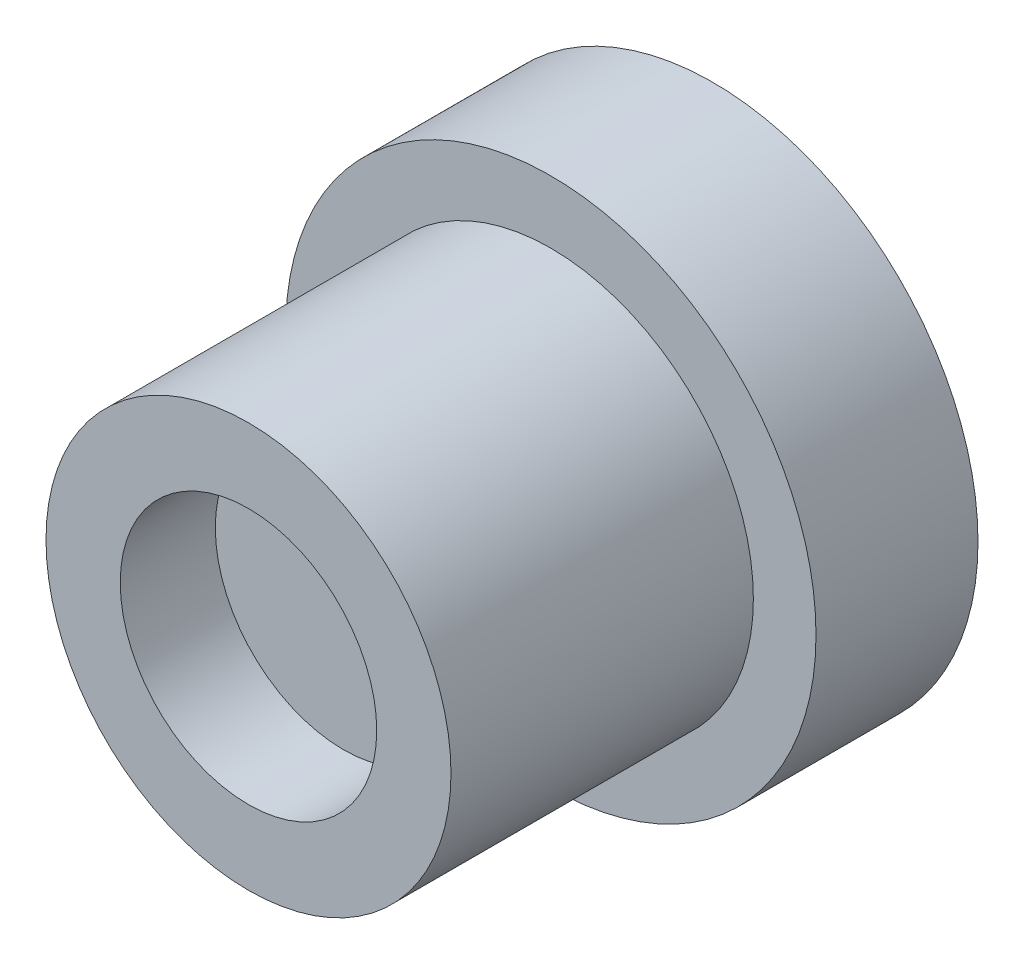
ISO-10303-21;
HEADER;
FILE_DESCRIPTION(('STEP AP214'),'2;1');
FILE_NAME('part.step','',(''),(''),'','','');
FILE_SCHEMA(('AUTOMOTIVE_DESIGN { 1 0 10303 214 1 1 1 1 }'));
ENDSEC;
DATA;
#1=APPLICATION_CONTEXT('core data for automotive mechanical design processes');
#2=APPLICATION_PROTOCOL_DEFINITION('international standard','automotive_design',2000,#1);
#3=PRODUCT_CONTEXT('',#1,'mechanical');
#4=PRODUCT('Part','Part','',(#3));
#5=PRODUCT_RELATED_PRODUCT_CATEGORY('part','',(#4));
#6=PRODUCT_DEFINITION_FORMATION('','',#4);
#7=PRODUCT_DEFINITION_CONTEXT('part definition',#1,'design');
#8=PRODUCT_DEFINITION('design','',#6,#7);
#9=PRODUCT_DEFINITION_SHAPE('','',#8);
#10=(LENGTH_UNIT() NAMED_UNIT(*) SI_UNIT(.MILLI.,.METRE.));
#11=(NAMED_UNIT(*) PLANE_ANGLE_UNIT() SI_UNIT($,.RADIAN.));
#12=(NAMED_UNIT(*) SI_UNIT($,.STERADIAN.) SOLID_ANGLE_UNIT());
#13=UNCERTAINTY_MEASURE_WITH_UNIT(LENGTH_MEASURE(1.E-05),#10,'distance_accuracy_value','');
#14=(GEOMETRIC_REPRESENTATION_CONTEXT(3) GLOBAL_UNCERTAINTY_ASSIGNED_CONTEXT((#13)) GLOBAL_UNIT_ASSIGNED_CONTEXT((#10,
#11,#12)) REPRESENTATION_CONTEXT('',''));
#15=CARTESIAN_POINT('',(0.,0.,0.));
#16=DIRECTION('',(0.,0.,1.));
#17=DIRECTION('',(1.,0.,0.));
#18=AXIS2_PLACEMENT_3D('',#15,#16,#17);
#19=CARTESIAN_POINT('',(0.,0.,3.));
#20=DIRECTION('',(0.,0.,-1.));
#21=DIRECTION('',(-1.,0.,0.));
#22=AXIS2_PLACEMENT_3D('',#19,#20,#21);
#23=CYLINDRICAL_SURFACE('',#22,4.91);
#24=CARTESIAN_POINT('',(0.,0.,3.));
#25=DIRECTION('',(0.,0.,1.));
#26=DIRECTION('',(1.,0.,0.));
#27=AXIS2_PLACEMENT_3D('',#24,#25,#26);
#28=CIRCLE('',#27,4.91);
#29=CARTESIAN_POINT('',(4.91,0.,3.));
#30=VERTEX_POINT('',#29);
#31=EDGE_CURVE('E47',#30,#30,#28,.T.);
#32=ORIENTED_EDGE('',*,*,#31,.F.);
#33=EDGE_LOOP('',(#32));
#34=FACE_BOUND('',#33,.T.);
#35=CARTESIAN_POINT('',(0.,0.,0.));
#36=DIRECTION('',(0.,0.,1.));
#37=DIRECTION('',(1.,0.,0.));
#38=AXIS2_PLACEMENT_3D('',#35,#36,#37);
#39=CIRCLE('',#38,4.91);
#40=CARTESIAN_POINT('',(4.91,0.,0.));
#41=VERTEX_POINT('',#40);
#42=EDGE_CURVE('E52',#41,#41,#39,.T.);
#43=ORIENTED_EDGE('',*,*,#42,.T.);
#44=EDGE_LOOP('',(#43));
#45=FACE_BOUND('',#44,.T.);
#46=ADVANCED_FACE('F37',(#34,#45),#23,.T.);
#47=CARTESIAN_POINT('',(0.,0.,3.));
#48=DIRECTION('',(0.,0.,1.));
#49=DIRECTION('',(1.,0.,0.));
#50=AXIS2_PLACEMENT_3D('',#47,#48,#49);
#51=PLANE('',#50);
#52=CARTESIAN_POINT('',(0.,0.,3.));
#53=DIRECTION('',(0.,0.,1.));
#54=DIRECTION('',(1.,0.,0.));
#55=AXIS2_PLACEMENT_3D('',#52,#53,#54);
#56=CIRCLE('',#55,3.75);
#57=CARTESIAN_POINT('',(3.75,0.,3.));
#58=VERTEX_POINT('',#57);
#59=EDGE_CURVE('E43',#58,#58,#56,.T.);
#60=ORIENTED_EDGE('',*,*,#59,.F.);
#61=EDGE_LOOP('',(#60));
#62=FACE_BOUND('',#61,.T.);
#63=ORIENTED_EDGE('',*,*,#31,.T.);
#64=EDGE_LOOP('',(#63));
#65=FACE_BOUND('',#64,.T.);
#66=ADVANCED_FACE('F83',(#62,#65),#51,.T.);
#67=CARTESIAN_POINT('',(0.,0.,0.));
#68=DIRECTION('',(0.,0.,1.));
#69=DIRECTION('',(1.,0.,0.));
#70=AXIS2_PLACEMENT_3D('',#67,#68,#69);
#71=PLANE('',#70);
#72=ORIENTED_EDGE('',*,*,#42,.F.);
#73=EDGE_LOOP('',(#72));
#74=FACE_BOUND('',#73,.T.);
#75=ADVANCED_FACE('F79',(#74),#71,.F.);
#76=CARTESIAN_POINT('',(0.,0.,6.84));
#77=DIRECTION('',(0.,0.,-1.));
#78=DIRECTION('',(-1.,0.,0.));
#79=AXIS2_PLACEMENT_3D('',#76,#77,#78);
#80=CYLINDRICAL_SURFACE('',#79,3.75);
#81=ORIENTED_EDGE('',*,*,#59,.T.);
#82=EDGE_LOOP('',(#81));
#83=FACE_BOUND('',#82,.T.);
#84=CARTESIAN_POINT('',(0.,0.,8.6));
#85=DIRECTION('',(0.,0.,1.));
#86=DIRECTION('',(1.,0.,0.));
#87=AXIS2_PLACEMENT_3D('',#84,#85,#86);
#88=CIRCLE('',#87,3.75);
#89=CARTESIAN_POINT('',(3.75,0.,8.6));
#90=VERTEX_POINT('',#89);
#91=EDGE_CURVE('E55',#90,#90,#88,.T.);
#92=ORIENTED_EDGE('',*,*,#91,.F.);
#93=EDGE_LOOP('',(#92));
#94=FACE_BOUND('',#93,.T.);
#95=ADVANCED_FACE('F71',(#83,#94),#80,.T.);
#96=CARTESIAN_POINT('',(0.,0.,8.6));
#97=DIRECTION('',(0.,0.,1.));
#98=DIRECTION('',(1.,0.,0.));
#99=AXIS2_PLACEMENT_3D('',#96,#97,#98);
#100=PLANE('',#99);
#101=ORIENTED_EDGE('',*,*,#91,.T.);
#102=EDGE_LOOP('',(#101));
#103=FACE_BOUND('',#102,.T.);
#104=CARTESIAN_POINT('',(0.,0.,8.6));
#105=DIRECTION('',(0.,0.,1.));
#106=DIRECTION('',(1.,0.,0.));
#107=AXIS2_PLACEMENT_3D('',#104,#105,#106);
#108=CIRCLE('',#107,2.375);
#109=CARTESIAN_POINT('',(2.375,0.,8.6));
#110=VERTEX_POINT('',#109);
#111=EDGE_CURVE('E61',#110,#110,#108,.T.);
#112=ORIENTED_EDGE('',*,*,#111,.F.);
#113=EDGE_LOOP('',(#112));
#114=FACE_BOUND('',#113,.T.);
#115=ADVANCED_FACE('F69',(#103,#114),#100,.T.);
#116=CARTESIAN_POINT('',(0.,0.,8.6));
#117=DIRECTION('',(0.,0.,-1.));
#118=DIRECTION('',(-1.,0.,0.));
#119=AXIS2_PLACEMENT_3D('',#116,#117,#118);
#120=CYLINDRICAL_SURFACE('',#119,2.375);
#121=ORIENTED_EDGE('',*,*,#111,.T.);
#122=EDGE_LOOP('',(#121));
#123=FACE_BOUND('',#122,.T.);
#124=CARTESIAN_POINT('',(0.,0.,6.84));
#125=DIRECTION('',(0.,0.,1.));
#126=DIRECTION('',(1.,0.,0.));
#127=AXIS2_PLACEMENT_3D('',#124,#125,#126);
#128=CIRCLE('',#127,2.375);
#129=CARTESIAN_POINT('',(2.375,0.,6.84));
#130=VERTEX_POINT('',#129);
#131=EDGE_CURVE('E10',#130,#130,#128,.F.);
#132=ORIENTED_EDGE('',*,*,#131,.T.);
#133=EDGE_LOOP('',(#132));
#134=FACE_BOUND('',#133,.T.);
#135=ADVANCED_FACE('F67',(#123,#134),#120,.F.);
#136=CARTESIAN_POINT('',(0.,0.,6.84));
#137=DIRECTION('',(0.,0.,1.));
#138=DIRECTION('',(1.,0.,0.));
#139=AXIS2_PLACEMENT_3D('',#136,#137,#138);
#140=PLANE('',#139);
#141=ORIENTED_EDGE('',*,*,#131,.F.);
#142=EDGE_LOOP('',(#141));
#143=FACE_BOUND('',#142,.T.);
#144=ADVANCED_FACE('F77',(#143),#140,.T.);
#145=CLOSED_SHELL('',(#46,#66,#75,#95,#115,#135,#144));
#146=MANIFOLD_SOLID_BREP('B2',#145);
#147=ADVANCED_BREP_SHAPE_REPRESENTATION('',(#18,#146),#14);
#148=SHAPE_DEFINITION_REPRESENTATION(#9,#147);
ENDSEC;
END-ISO-10303-21;
